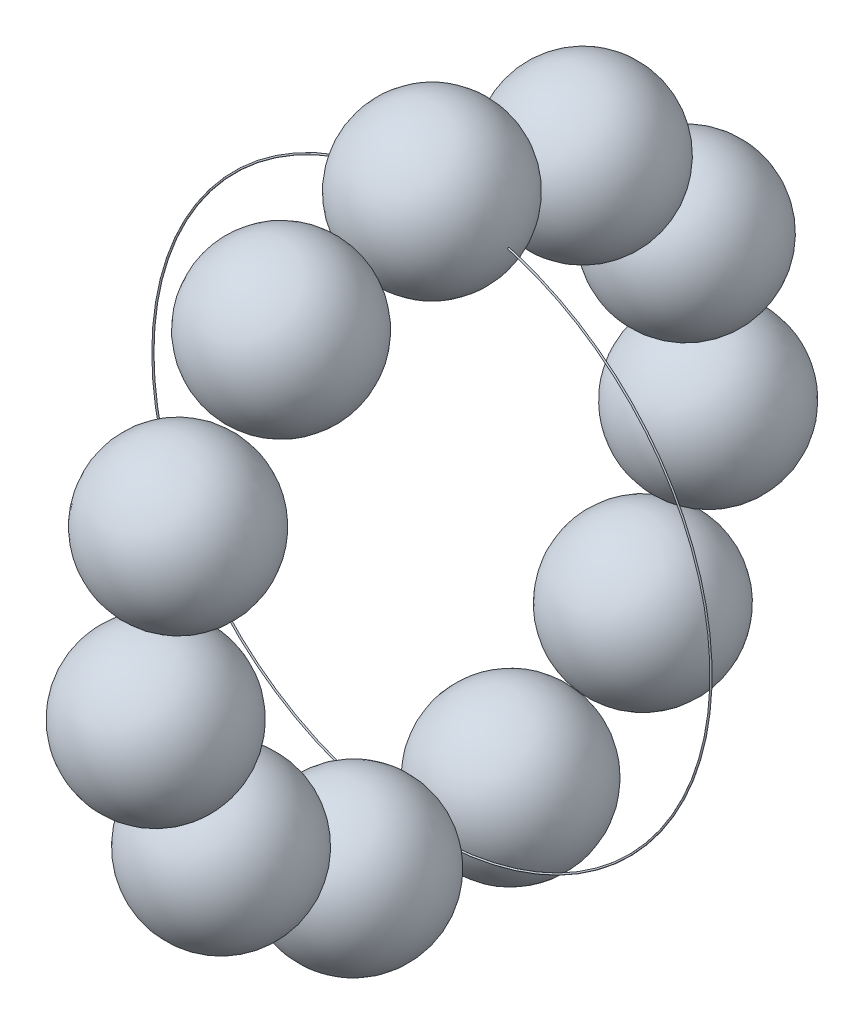
ISO-10303-21;
HEADER;
FILE_DESCRIPTION(('STEP AP214'),'2;1');
FILE_NAME('part.step','',(''),(''),'','','');
FILE_SCHEMA(('AUTOMOTIVE_DESIGN { 1 0 10303 214 1 1 1 1 }'));
ENDSEC;
DATA;
#1=APPLICATION_CONTEXT('core data for automotive mechanical design processes');
#2=APPLICATION_PROTOCOL_DEFINITION('international standard','automotive_design',2000,#1);
#3=PRODUCT_CONTEXT('',#1,'mechanical');
#4=PRODUCT('Part','Part','',(#3));
#5=PRODUCT_RELATED_PRODUCT_CATEGORY('part','',(#4));
#6=PRODUCT_DEFINITION_FORMATION('','',#4);
#7=PRODUCT_DEFINITION_CONTEXT('part definition',#1,'design');
#8=PRODUCT_DEFINITION('design','',#6,#7);
#9=PRODUCT_DEFINITION_SHAPE('','',#8);
#10=(LENGTH_UNIT() NAMED_UNIT(*) SI_UNIT(.MILLI.,.METRE.));
#11=(NAMED_UNIT(*) PLANE_ANGLE_UNIT() SI_UNIT($,.RADIAN.));
#12=(NAMED_UNIT(*) SI_UNIT($,.STERADIAN.) SOLID_ANGLE_UNIT());
#13=UNCERTAINTY_MEASURE_WITH_UNIT(LENGTH_MEASURE(1.E-05),#10,'distance_accuracy_value','');
#14=(GEOMETRIC_REPRESENTATION_CONTEXT(3) GLOBAL_UNCERTAINTY_ASSIGNED_CONTEXT((#13)) GLOBAL_UNIT_ASSIGNED_CONTEXT((#10,
#11,#12)) REPRESENTATION_CONTEXT('',''));
#15=CARTESIAN_POINT('',(0.,0.,0.));
#16=DIRECTION('',(0.,0.,1.));
#17=DIRECTION('',(1.,0.,0.));
#18=AXIS2_PLACEMENT_3D('',#15,#16,#17);
#19=CARTESIAN_POINT('',(0.,15.1425635909614,-9.73153471420055));
#20=DIRECTION('',(0.,-0.841253532831188,0.540640817455586));
#21=DIRECTION('',(-1.,0.,0.));
#22=AXIS2_PLACEMENT_3D('',#19,#20,#21);
#23=SPHERICAL_SURFACE('',#22,5.);
#24=CARTESIAN_POINT('',(0.,10.9362959268054,-7.02833062692262));
#25=VERTEX_POINT('',#24);
#26=VERTEX_LOOP('',#25);
#27=FACE_BOUND('',#26,.T.);
#28=ADVANCED_FACE('F37',(#27),#23,.T.);
#29=CLOSED_SHELL('',(#28));
#30=MANIFOLD_SOLID_BREP('B2',#29);
#31=CARTESIAN_POINT('',(0.,7.47747023403415,-16.3733759163812));
#32=DIRECTION('',(0.,-0.415415013001897,0.909631995354513));
#33=DIRECTION('',(-1.,0.,0.));
#34=AXIS2_PLACEMENT_3D('',#31,#32,#33);
#35=SPHERICAL_SURFACE('',#34,5.);
#36=CARTESIAN_POINT('',(0.,5.40039516902467,-11.8252159396087));
#37=VERTEX_POINT('',#36);
#38=VERTEX_LOOP('',#37);
#39=FACE_BOUND('',#38,.T.);
#40=ADVANCED_FACE('F55',(#39),#35,.T.);
#41=CLOSED_SHELL('',(#40));
#42=MANIFOLD_SOLID_BREP('B6',#41);
#43=CARTESIAN_POINT('',(0.,-2.56166708891894,-17.8167859538568));
#44=DIRECTION('',(0.,0.142314838273275,0.989821441880934));
#45=DIRECTION('',(-1.,0.,0.));
#46=AXIS2_PLACEMENT_3D('',#43,#44,#45);
#47=SPHERICAL_SURFACE('',#46,5.);
#48=CARTESIAN_POINT('',(0.,-1.85009289755257,-12.8676787444521));
#49=VERTEX_POINT('',#48);
#50=VERTEX_LOOP('',#49);
#51=FACE_BOUND('',#50,.T.);
#52=ADVANCED_FACE('F73',(#51),#47,.T.);
#53=CLOSED_SHELL('',(#52));
#54=MANIFOLD_SOLID_BREP('B33',#53);
#55=CARTESIAN_POINT('',(0.,-11.787493211015,-13.6034923383768));
#56=DIRECTION('',(0.,0.654860733945278,0.755749574354264));
#57=DIRECTION('',(-1.,0.,0.));
#58=AXIS2_PLACEMENT_3D('',#55,#56,#57);
#59=SPHERICAL_SURFACE('',#58,5.);
#60=CARTESIAN_POINT('',(0.,-8.51318954128862,-9.82474446660544));
#61=VERTEX_POINT('',#60);
#62=VERTEX_LOOP('',#61);
#63=FACE_BOUND('',#62,.T.);
#64=ADVANCED_FACE('F91',(#63),#59,.T.);
#65=CLOSED_SHELL('',(#64));
#66=MANIFOLD_SOLID_BREP('B51',#65);
#67=CARTESIAN_POINT('',(0.,-17.2708735250609,-5.07118602314587));
#68=DIRECTION('',(0.,0.959492973614495,0.281732556841437));
#69=DIRECTION('',(-1.,0.,0.));
#70=AXIS2_PLACEMENT_3D('',#67,#68,#69);
#71=SPHERICAL_SURFACE('',#70,5.);
#72=CARTESIAN_POINT('',(0.,-12.4734086569884,-3.66252323893868));
#73=VERTEX_POINT('',#72);
#74=VERTEX_LOOP('',#73);
#75=FACE_BOUND('',#74,.T.);
#76=ADVANCED_FACE('F109',(#75),#71,.T.);
#77=CLOSED_SHELL('',(#76));
#78=MANIFOLD_SOLID_BREP('B69',#77);
#79=CARTESIAN_POINT('',(0.,-17.270873525061,5.07118602314562));
#80=DIRECTION('',(0.,0.959492973614499,-0.281732556841423));
#81=DIRECTION('',(-1.,0.,0.));
#82=AXIS2_PLACEMENT_3D('',#79,#80,#81);
#83=SPHERICAL_SURFACE('',#82,5.);
#84=CARTESIAN_POINT('',(0.,-12.4734086569885,3.6625232389385));
#85=VERTEX_POINT('',#84);
#86=VERTEX_LOOP('',#85);
#87=FACE_BOUND('',#86,.T.);
#88=ADVANCED_FACE('F127',(#87),#83,.T.);
#89=CLOSED_SHELL('',(#88));
#90=MANIFOLD_SOLID_BREP('B87',#89);
#91=CARTESIAN_POINT('',(0.,-11.7874932110152,13.6034923383766));
#92=DIRECTION('',(0.,0.654860733945289,-0.755749574354255));
#93=DIRECTION('',(-1.,0.,0.));
#94=AXIS2_PLACEMENT_3D('',#91,#92,#93);
#95=SPHERICAL_SURFACE('',#94,5.);
#96=CARTESIAN_POINT('',(0.,-8.51318954128876,9.82474446660532));
#97=VERTEX_POINT('',#96);
#98=VERTEX_LOOP('',#97);
#99=FACE_BOUND('',#98,.T.);
#100=ADVANCED_FACE('F145',(#99),#95,.T.);
#101=CLOSED_SHELL('',(#100));
#102=MANIFOLD_SOLID_BREP('B105',#101);
#103=CARTESIAN_POINT('',(0.,-2.5616670889192,17.8167859538568));
#104=DIRECTION('',(0.,0.142314838273289,-0.989821441880932));
#105=DIRECTION('',(-1.,0.,0.));
#106=AXIS2_PLACEMENT_3D('',#103,#104,#105);
#107=SPHERICAL_SURFACE('',#106,5.);
#108=CARTESIAN_POINT('',(0.,-1.85009289755276,12.8676787444521));
#109=VERTEX_POINT('',#108);
#110=VERTEX_LOOP('',#109);
#111=FACE_BOUND('',#110,.T.);
#112=ADVANCED_FACE('F163',(#111),#107,.T.);
#113=CLOSED_SHELL('',(#112));
#114=MANIFOLD_SOLID_BREP('B123',#113);
#115=CARTESIAN_POINT('',(0.,7.47747023403391,16.3733759163814));
#116=DIRECTION('',(0.,-0.415415013001884,-0.909631995354519));
#117=DIRECTION('',(-1.,0.,0.));
#118=AXIS2_PLACEMENT_3D('',#115,#116,#117);
#119=SPHERICAL_SURFACE('',#118,5.);
#120=CARTESIAN_POINT('',(0.,5.40039516902449,11.8252159396088));
#121=VERTEX_POINT('',#120);
#122=VERTEX_LOOP('',#121);
#123=FACE_BOUND('',#122,.T.);
#124=ADVANCED_FACE('F181',(#123),#119,.T.);
#125=CLOSED_SHELL('',(#124));
#126=MANIFOLD_SOLID_BREP('B141',#125);
#127=CARTESIAN_POINT('',(0.,15.1425635909613,9.73153471420078));
#128=DIRECTION('',(0.,-0.841253532831181,-0.540640817455599));
#129=DIRECTION('',(-1.,0.,0.));
#130=AXIS2_PLACEMENT_3D('',#127,#128,#129);
#131=SPHERICAL_SURFACE('',#130,5.);
#132=CARTESIAN_POINT('',(0.,10.9362959268054,7.02833062692278));
#133=VERTEX_POINT('',#132);
#134=VERTEX_LOOP('',#133);
#135=FACE_BOUND('',#134,.T.);
#136=ADVANCED_FACE('F199',(#135),#131,.T.);
#137=CLOSED_SHELL('',(#136));
#138=MANIFOLD_SOLID_BREP('B159',#137);
#139=CARTESIAN_POINT('',(0.,0.,0.));
#140=DIRECTION('',(0.,0.,-1.));
#141=DIRECTION('',(-1.,0.,0.));
#142=AXIS2_PLACEMENT_3D('',#139,#140,#141);
#143=TOROIDAL_SURFACE('',#142,18.,0.0499999999999971);
#144=CARTESIAN_POINT('',(-18.05,0.,0.));
#145=VERTEX_POINT('',#144);
#146=VERTEX_LOOP('',#145);
#147=FACE_BOUND('',#146,.T.);
#148=ADVANCED_FACE('F216',(#147),#143,.T.);
#149=CLOSED_SHELL('',(#148));
#150=MANIFOLD_SOLID_BREP('B177_NOT_SHOWN',#149);
#151=CARTESIAN_POINT('',(0.,18.,0.));
#152=DIRECTION('',(0.,-1.,0.));
#153=DIRECTION('',(-1.,0.,0.));
#154=AXIS2_PLACEMENT_3D('',#151,#152,#153);
#155=SPHERICAL_SURFACE('',#154,5.);
#156=CARTESIAN_POINT('',(0.,13.,0.));
#157=VERTEX_POINT('',#156);
#158=VERTEX_LOOP('',#157);
#159=FACE_BOUND('',#158,.T.);
#160=ADVANCED_FACE('F228',(#159),#155,.T.);
#161=CLOSED_SHELL('',(#160));
#162=MANIFOLD_SOLID_BREP('B195',#161);
#163=ADVANCED_BREP_SHAPE_REPRESENTATION('',(#18,#30,#42,#54,#66,#78,#90,#102,#114,#126,#138,
#150,#162),#14);
#164=SHAPE_DEFINITION_REPRESENTATION(#9,#163);
ENDSEC;
END-ISO-10303-21;
